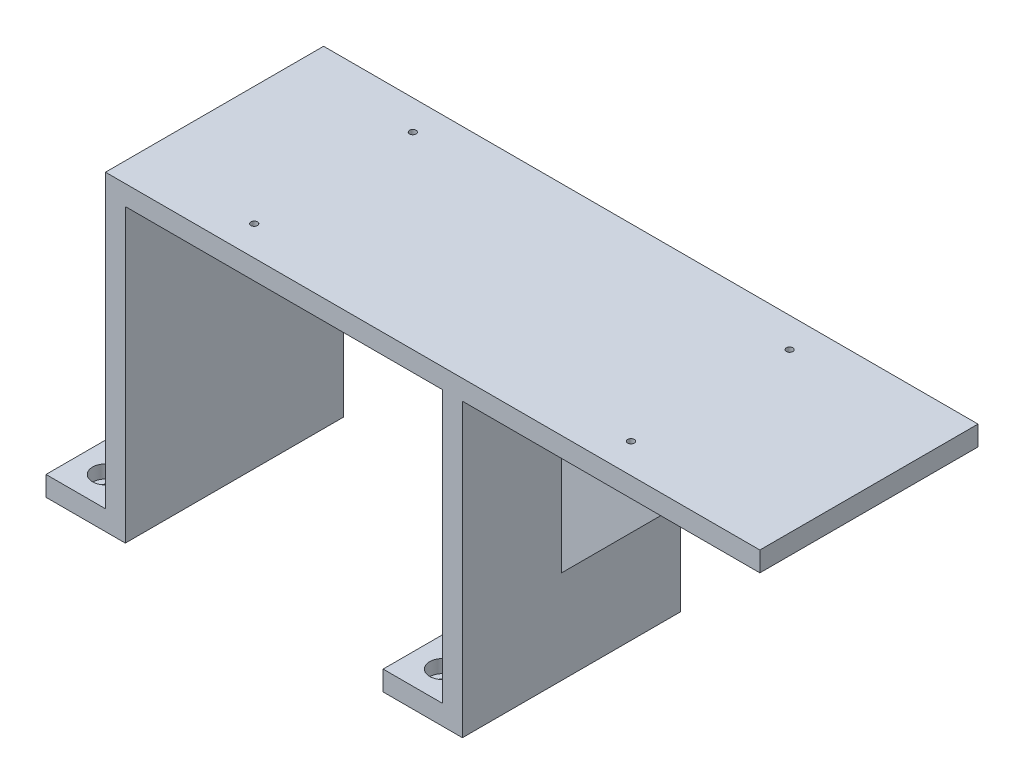
ISO-10303-21;
HEADER;
FILE_DESCRIPTION(('STEP AP214'),'2;1');
FILE_NAME('part.step','',(''),(''),'','','');
FILE_SCHEMA(('AUTOMOTIVE_DESIGN { 1 0 10303 214 1 1 1 1 }'));
ENDSEC;
DATA;
#1=APPLICATION_CONTEXT('core data for automotive mechanical design processes');
#2=APPLICATION_PROTOCOL_DEFINITION('international standard','automotive_design',2000,#1);
#3=PRODUCT_CONTEXT('',#1,'mechanical');
#4=PRODUCT('Part','Part','',(#3));
#5=PRODUCT_RELATED_PRODUCT_CATEGORY('part','',(#4));
#6=PRODUCT_DEFINITION_FORMATION('','',#4);
#7=PRODUCT_DEFINITION_CONTEXT('part definition',#1,'design');
#8=PRODUCT_DEFINITION('design','',#6,#7);
#9=PRODUCT_DEFINITION_SHAPE('','',#8);
#10=(LENGTH_UNIT() NAMED_UNIT(*) SI_UNIT(.MILLI.,.METRE.));
#11=(NAMED_UNIT(*) PLANE_ANGLE_UNIT() SI_UNIT($,.RADIAN.));
#12=(NAMED_UNIT(*) SI_UNIT($,.STERADIAN.) SOLID_ANGLE_UNIT());
#13=UNCERTAINTY_MEASURE_WITH_UNIT(LENGTH_MEASURE(1.E-05),#10,'distance_accuracy_value','');
#14=(GEOMETRIC_REPRESENTATION_CONTEXT(3) GLOBAL_UNCERTAINTY_ASSIGNED_CONTEXT((#13)) GLOBAL_UNIT_ASSIGNED_CONTEXT((#10,
#11,#12)) REPRESENTATION_CONTEXT('',''));
#15=CARTESIAN_POINT('',(0.,0.,0.));
#16=DIRECTION('',(0.,0.,1.));
#17=DIRECTION('',(1.,0.,0.));
#18=AXIS2_PLACEMENT_3D('',#15,#16,#17);
#19=CARTESIAN_POINT('',(210.,147.,110.));
#20=DIRECTION('',(-1.,0.,0.));
#21=DIRECTION('',(0.,-1.,0.));
#22=AXIS2_PLACEMENT_3D('',#19,#20,#21);
#23=PLANE('',#22);
#24=DIRECTION('',(0.,-1.,0.));
#25=VECTOR('',#24,1.);
#26=CARTESIAN_POINT('',(210.,137.,60.));
#27=LINE('',#26,#25);
#28=CARTESIAN_POINT('',(210.,137.,60.));
#29=VERTEX_POINT('',#28);
#30=CARTESIAN_POINT('',(210.,37.,60.));
#31=VERTEX_POINT('',#30);
#32=EDGE_CURVE('E183',#29,#31,#27,.T.);
#33=ORIENTED_EDGE('',*,*,#32,.F.);
#34=DIRECTION('',(0.,0.,1.));
#35=VECTOR('',#34,1.);
#36=CARTESIAN_POINT('',(210.,137.,0.));
#37=LINE('',#36,#35);
#38=CARTESIAN_POINT('',(210.,137.,110.));
#39=VERTEX_POINT('',#38);
#40=EDGE_CURVE('E203',#29,#39,#37,.T.);
#41=ORIENTED_EDGE('',*,*,#40,.T.);
#42=DIRECTION('',(0.,1.,0.));
#43=VECTOR('',#42,1.);
#44=CARTESIAN_POINT('',(210.,147.,110.));
#45=LINE('',#44,#43);
#46=CARTESIAN_POINT('',(210.,-10.,110.));
#47=VERTEX_POINT('',#46);
#48=EDGE_CURVE('E296',#47,#39,#45,.T.);
#49=ORIENTED_EDGE('',*,*,#48,.F.);
#50=DIRECTION('',(0.,0.,-1.));
#51=VECTOR('',#50,1.);
#52=CARTESIAN_POINT('',(210.,-10.,110.));
#53=LINE('',#52,#51);
#54=CARTESIAN_POINT('',(210.,-10.,0.));
#55=VERTEX_POINT('',#54);
#56=EDGE_CURVE('E357',#47,#55,#53,.T.);
#57=ORIENTED_EDGE('',*,*,#56,.T.);
#58=DIRECTION('',(0.,1.,0.));
#59=VECTOR('',#58,1.);
#60=CARTESIAN_POINT('',(210.,147.,0.));
#61=LINE('',#60,#59);
#62=CARTESIAN_POINT('',(210.,137.,0.));
#63=VERTEX_POINT('',#62);
#64=EDGE_CURVE('E334',#55,#63,#61,.T.);
#65=ORIENTED_EDGE('',*,*,#64,.T.);
#66=CARTESIAN_POINT('',(210.,137.,50.));
#67=VERTEX_POINT('',#66);
#68=EDGE_CURVE('E218',#63,#67,#37,.T.);
#69=ORIENTED_EDGE('',*,*,#68,.T.);
#70=DIRECTION('',(0.,-1.,0.));
#71=VECTOR('',#70,1.);
#72=CARTESIAN_POINT('',(210.,137.,50.));
#73=LINE('',#72,#71);
#74=CARTESIAN_POINT('',(210.,37.,50.));
#75=VERTEX_POINT('',#74);
#76=EDGE_CURVE('E66',#67,#75,#73,.T.);
#77=ORIENTED_EDGE('',*,*,#76,.T.);
#78=DIRECTION('',(0.,0.,-1.));
#79=VECTOR('',#78,1.);
#80=CARTESIAN_POINT('',(210.,37.,60.));
#81=LINE('',#80,#79);
#82=EDGE_CURVE('E61',#31,#75,#81,.T.);
#83=ORIENTED_EDGE('',*,*,#82,.F.);
#84=EDGE_LOOP('',(#33,#41,#49,#57,#65,#69,#77,#83));
#85=FACE_BOUND('',#84,.T.);
#86=ADVANCED_FACE('F43',(#85),#23,.F.);
#87=CARTESIAN_POINT('',(210.,137.,0.));
#88=DIRECTION('',(0.,-1.,0.));
#89=DIRECTION('',(0.,0.,-1.));
#90=AXIS2_PLACEMENT_3D('',#87,#88,#89);
#91=PLANE('',#90);
#92=CARTESIAN_POINT('',(280.,137.,15.));
#93=DIRECTION('',(0.,-1.,0.));
#94=DIRECTION('',(0.,0.,-1.));
#95=AXIS2_PLACEMENT_3D('',#92,#93,#94);
#96=CIRCLE('',#95,1.64999999999998);
#97=CARTESIAN_POINT('',(280.,137.,13.35));
#98=VERTEX_POINT('',#97);
#99=EDGE_CURVE('E535',#98,#98,#96,.T.);
#100=ORIENTED_EDGE('',*,*,#99,.F.);
#101=EDGE_LOOP('',(#100));
#102=FACE_BOUND('',#101,.T.);
#103=CARTESIAN_POINT('',(280.,137.,95.));
#104=DIRECTION('',(0.,-1.,0.));
#105=DIRECTION('',(0.,0.,-1.));
#106=AXIS2_PLACEMENT_3D('',#103,#104,#105);
#107=CIRCLE('',#106,1.64999999999998);
#108=CARTESIAN_POINT('',(280.,137.,93.35));
#109=VERTEX_POINT('',#108);
#110=EDGE_CURVE('E525',#109,#109,#107,.T.);
#111=ORIENTED_EDGE('',*,*,#110,.F.);
#112=EDGE_LOOP('',(#111));
#113=FACE_BOUND('',#112,.T.);
#114=ORIENTED_EDGE('',*,*,#40,.F.);
#115=DIRECTION('',(-1.,0.,0.));
#116=VECTOR('',#115,1.);
#117=CARTESIAN_POINT('',(310.,137.,60.));
#118=LINE('',#117,#116);
#119=CARTESIAN_POINT('',(310.,137.,60.));
#120=VERTEX_POINT('',#119);
#121=EDGE_CURVE('E171',#120,#29,#118,.T.);
#122=ORIENTED_EDGE('',*,*,#121,.F.);
#123=DIRECTION('',(0.,0.,-1.));
#124=VECTOR('',#123,1.);
#125=CARTESIAN_POINT('',(310.,137.,60.));
#126=LINE('',#125,#124);
#127=CARTESIAN_POINT('',(310.,137.,50.));
#128=VERTEX_POINT('',#127);
#129=EDGE_CURVE('E164',#120,#128,#126,.T.);
#130=ORIENTED_EDGE('',*,*,#129,.T.);
#131=DIRECTION('',(-1.,0.,0.));
#132=VECTOR('',#131,1.);
#133=CARTESIAN_POINT('',(310.,137.,50.));
#134=LINE('',#133,#132);
#135=EDGE_CURVE('E169',#128,#67,#134,.T.);
#136=ORIENTED_EDGE('',*,*,#135,.T.);
#137=ORIENTED_EDGE('',*,*,#68,.F.);
#138=DIRECTION('',(1.,0.,0.));
#139=VECTOR('',#138,1.);
#140=CARTESIAN_POINT('',(210.,137.,0.));
#141=LINE('',#140,#139);
#142=CARTESIAN_POINT('',(360.,137.,0.));
#143=VERTEX_POINT('',#142);
#144=EDGE_CURVE('E194',#63,#143,#141,.T.);
#145=ORIENTED_EDGE('',*,*,#144,.T.);
#146=DIRECTION('',(0.,0.,1.));
#147=VECTOR('',#146,1.);
#148=CARTESIAN_POINT('',(360.,137.,0.));
#149=LINE('',#148,#147);
#150=CARTESIAN_POINT('',(360.,137.,110.));
#151=VERTEX_POINT('',#150);
#152=EDGE_CURVE('E215',#143,#151,#149,.T.);
#153=ORIENTED_EDGE('',*,*,#152,.T.);
#154=DIRECTION('',(1.,0.,0.));
#155=VECTOR('',#154,1.);
#156=CARTESIAN_POINT('',(210.,137.,110.));
#157=LINE('',#156,#155);
#158=EDGE_CURVE('E193',#39,#151,#157,.T.);
#159=ORIENTED_EDGE('',*,*,#158,.F.);
#160=EDGE_LOOP('',(#114,#122,#130,#136,#137,#145,#153,#159));
#161=FACE_BOUND('',#160,.T.);
#162=ADVANCED_FACE('F167',(#102,#113,#161),#91,.T.);
#163=CARTESIAN_POINT('',(15.,-10.,15.));
#164=DIRECTION('',(0.,1.,0.));
#165=DIRECTION('',(0.,0.,1.));
#166=AXIS2_PLACEMENT_3D('',#163,#164,#165);
#167=CYLINDRICAL_SURFACE('',#166,3.3);
#168=CARTESIAN_POINT('',(15.,-10.,15.));
#169=DIRECTION('',(0.,1.,0.));
#170=DIRECTION('',(0.,0.,1.));
#171=AXIS2_PLACEMENT_3D('',#168,#169,#170);
#172=CIRCLE('',#171,3.3);
#173=CARTESIAN_POINT('',(15.,-10.,18.3));
#174=VERTEX_POINT('',#173);
#175=EDGE_CURVE('E257',#174,#174,#172,.T.);
#176=ORIENTED_EDGE('',*,*,#175,.F.);
#177=EDGE_LOOP('',(#176));
#178=FACE_BOUND('',#177,.T.);
#179=CARTESIAN_POINT('',(15.,-6.6,15.));
#180=DIRECTION('',(0.,1.,0.));
#181=DIRECTION('',(0.,0.,1.));
#182=AXIS2_PLACEMENT_3D('',#179,#180,#181);
#183=CIRCLE('',#182,3.3);
#184=CARTESIAN_POINT('',(15.,-6.6,18.3));
#185=VERTEX_POINT('',#184);
#186=EDGE_CURVE('E47',#185,#185,#183,.F.);
#187=ORIENTED_EDGE('',*,*,#186,.F.);
#188=EDGE_LOOP('',(#187));
#189=FACE_BOUND('',#188,.T.);
#190=ADVANCED_FACE('F401',(#178,#189),#167,.F.);
#191=CARTESIAN_POINT('',(15.,-10.,95.));
#192=DIRECTION('',(0.,1.,0.));
#193=DIRECTION('',(0.,0.,1.));
#194=AXIS2_PLACEMENT_3D('',#191,#192,#193);
#195=CYLINDRICAL_SURFACE('',#194,3.3);
#196=CARTESIAN_POINT('',(15.,-10.,95.));
#197=DIRECTION('',(0.,1.,0.));
#198=DIRECTION('',(0.,0.,1.));
#199=AXIS2_PLACEMENT_3D('',#196,#197,#198);
#200=CIRCLE('',#199,3.3);
#201=CARTESIAN_POINT('',(15.,-10.,98.3));
#202=VERTEX_POINT('',#201);
#203=EDGE_CURVE('E253',#202,#202,#200,.T.);
#204=ORIENTED_EDGE('',*,*,#203,.F.);
#205=EDGE_LOOP('',(#204));
#206=FACE_BOUND('',#205,.T.);
#207=CARTESIAN_POINT('',(15.,-6.6,95.));
#208=DIRECTION('',(0.,1.,0.));
#209=DIRECTION('',(0.,0.,1.));
#210=AXIS2_PLACEMENT_3D('',#207,#208,#209);
#211=CIRCLE('',#210,3.3);
#212=CARTESIAN_POINT('',(15.,-6.6,98.3));
#213=VERTEX_POINT('',#212);
#214=EDGE_CURVE('E390',#213,#213,#211,.F.);
#215=ORIENTED_EDGE('',*,*,#214,.F.);
#216=EDGE_LOOP('',(#215));
#217=FACE_BOUND('',#216,.T.);
#218=ADVANCED_FACE('F403',(#206,#217),#195,.F.);
#219=CARTESIAN_POINT('',(185.,-10.,95.));
#220=DIRECTION('',(0.,1.,0.));
#221=DIRECTION('',(0.,0.,1.));
#222=AXIS2_PLACEMENT_3D('',#219,#220,#221);
#223=CYLINDRICAL_SURFACE('',#222,3.3);
#224=CARTESIAN_POINT('',(185.,-10.,95.));
#225=DIRECTION('',(0.,1.,0.));
#226=DIRECTION('',(0.,0.,1.));
#227=AXIS2_PLACEMENT_3D('',#224,#225,#226);
#228=CIRCLE('',#227,3.3);
#229=CARTESIAN_POINT('',(185.,-10.,98.3));
#230=VERTEX_POINT('',#229);
#231=EDGE_CURVE('E258',#230,#230,#228,.T.);
#232=ORIENTED_EDGE('',*,*,#231,.F.);
#233=EDGE_LOOP('',(#232));
#234=FACE_BOUND('',#233,.T.);
#235=CARTESIAN_POINT('',(185.,-6.6,95.));
#236=DIRECTION('',(0.,1.,0.));
#237=DIRECTION('',(0.,0.,1.));
#238=AXIS2_PLACEMENT_3D('',#235,#236,#237);
#239=CIRCLE('',#238,3.3);
#240=CARTESIAN_POINT('',(185.,-6.6,98.3));
#241=VERTEX_POINT('',#240);
#242=EDGE_CURVE('E387',#241,#241,#239,.F.);
#243=ORIENTED_EDGE('',*,*,#242,.F.);
#244=EDGE_LOOP('',(#243));
#245=FACE_BOUND('',#244,.T.);
#246=ADVANCED_FACE('F410',(#234,#245),#223,.F.);
#247=CARTESIAN_POINT('',(185.,-10.,15.));
#248=DIRECTION('',(0.,1.,0.));
#249=DIRECTION('',(0.,0.,1.));
#250=AXIS2_PLACEMENT_3D('',#247,#248,#249);
#251=CYLINDRICAL_SURFACE('',#250,3.3);
#252=CARTESIAN_POINT('',(185.,-10.,15.));
#253=DIRECTION('',(0.,1.,0.));
#254=DIRECTION('',(0.,0.,1.));
#255=AXIS2_PLACEMENT_3D('',#252,#253,#254);
#256=CIRCLE('',#255,3.3);
#257=CARTESIAN_POINT('',(185.,-10.,18.3));
#258=VERTEX_POINT('',#257);
#259=EDGE_CURVE('E262',#258,#258,#256,.T.);
#260=ORIENTED_EDGE('',*,*,#259,.F.);
#261=EDGE_LOOP('',(#260));
#262=FACE_BOUND('',#261,.T.);
#263=CARTESIAN_POINT('',(185.,-6.6,15.));
#264=DIRECTION('',(0.,1.,0.));
#265=DIRECTION('',(0.,0.,1.));
#266=AXIS2_PLACEMENT_3D('',#263,#264,#265);
#267=CIRCLE('',#266,3.3);
#268=CARTESIAN_POINT('',(185.,-6.6,18.3));
#269=VERTEX_POINT('',#268);
#270=EDGE_CURVE('E249',#269,#269,#267,.F.);
#271=ORIENTED_EDGE('',*,*,#270,.F.);
#272=EDGE_LOOP('',(#271));
#273=FACE_BOUND('',#272,.T.);
#274=ADVANCED_FACE('F455',(#262,#273),#251,.F.);
#275=CARTESIAN_POINT('',(0.,0.,110.));
#276=DIRECTION('',(1.,0.,0.));
#277=DIRECTION('',(0.,1.,0.));
#278=AXIS2_PLACEMENT_3D('',#275,#276,#277);
#279=PLANE('',#278);
#280=DIRECTION('',(0.,-1.,0.));
#281=VECTOR('',#280,1.);
#282=CARTESIAN_POINT('',(0.,0.,0.));
#283=LINE('',#282,#281);
#284=CARTESIAN_POINT('',(0.,0.,0.));
#285=VERTEX_POINT('',#284);
#286=CARTESIAN_POINT('',(0.,-10.,0.));
#287=VERTEX_POINT('',#286);
#288=EDGE_CURVE('E269',#285,#287,#283,.T.);
#289=ORIENTED_EDGE('',*,*,#288,.T.);
#290=DIRECTION('',(0.,0.,-1.));
#291=VECTOR('',#290,1.);
#292=CARTESIAN_POINT('',(0.,-10.,110.));
#293=LINE('',#292,#291);
#294=CARTESIAN_POINT('',(0.,-10.,110.));
#295=VERTEX_POINT('',#294);
#296=EDGE_CURVE('E11',#295,#287,#293,.T.);
#297=ORIENTED_EDGE('',*,*,#296,.F.);
#298=DIRECTION('',(0.,-1.,0.));
#299=VECTOR('',#298,1.);
#300=CARTESIAN_POINT('',(0.,0.,110.));
#301=LINE('',#300,#299);
#302=CARTESIAN_POINT('',(0.,0.,110.));
#303=VERTEX_POINT('',#302);
#304=EDGE_CURVE('E270',#303,#295,#301,.T.);
#305=ORIENTED_EDGE('',*,*,#304,.F.);
#306=DIRECTION('',(0.,0.,-1.));
#307=VECTOR('',#306,1.);
#308=CARTESIAN_POINT('',(0.,0.,110.));
#309=LINE('',#308,#307);
#310=EDGE_CURVE('E309',#303,#285,#309,.T.);
#311=ORIENTED_EDGE('',*,*,#310,.T.);
#312=EDGE_LOOP('',(#289,#297,#305,#311));
#313=FACE_BOUND('',#312,.T.);
#314=ADVANCED_FACE('F45',(#313),#279,.F.);
#315=CARTESIAN_POINT('',(0.,-10.,110.));
#316=DIRECTION('',(0.,1.,0.));
#317=DIRECTION('',(0.,0.,1.));
#318=AXIS2_PLACEMENT_3D('',#315,#316,#317);
#319=PLANE('',#318);
#320=ORIENTED_EDGE('',*,*,#203,.T.);
#321=EDGE_LOOP('',(#320));
#322=FACE_BOUND('',#321,.T.);
#323=ORIENTED_EDGE('',*,*,#175,.T.);
#324=EDGE_LOOP('',(#323));
#325=FACE_BOUND('',#324,.T.);
#326=DIRECTION('',(1.,0.,0.));
#327=VECTOR('',#326,1.);
#328=CARTESIAN_POINT('',(0.,-10.,0.));
#329=LINE('',#328,#327);
#330=CARTESIAN_POINT('',(40.,-10.,0.));
#331=VERTEX_POINT('',#330);
#332=EDGE_CURVE('E313',#287,#331,#329,.T.);
#333=ORIENTED_EDGE('',*,*,#332,.T.);
#334=DIRECTION('',(0.,0.,-1.));
#335=VECTOR('',#334,1.);
#336=CARTESIAN_POINT('',(40.,-10.,110.));
#337=LINE('',#336,#335);
#338=CARTESIAN_POINT('',(40.,-10.,110.));
#339=VERTEX_POINT('',#338);
#340=EDGE_CURVE('E53',#339,#331,#337,.T.);
#341=ORIENTED_EDGE('',*,*,#340,.F.);
#342=DIRECTION('',(1.,0.,0.));
#343=VECTOR('',#342,1.);
#344=CARTESIAN_POINT('',(0.,-10.,110.));
#345=LINE('',#344,#343);
#346=EDGE_CURVE('E274',#295,#339,#345,.T.);
#347=ORIENTED_EDGE('',*,*,#346,.F.);
#348=ORIENTED_EDGE('',*,*,#296,.T.);
#349=EDGE_LOOP('',(#333,#341,#347,#348));
#350=FACE_BOUND('',#349,.T.);
#351=ADVANCED_FACE('F448',(#322,#325,#350),#319,.F.);
#352=CARTESIAN_POINT('',(40.,-10.,110.));
#353=DIRECTION('',(-1.,0.,0.));
#354=DIRECTION('',(0.,0.,1.));
#355=AXIS2_PLACEMENT_3D('',#352,#353,#354);
#356=PLANE('',#355);
#357=DIRECTION('',(0.,1.,0.));
#358=VECTOR('',#357,1.);
#359=CARTESIAN_POINT('',(40.,-10.,0.));
#360=LINE('',#359,#358);
#361=CARTESIAN_POINT('',(40.,137.,0.));
#362=VERTEX_POINT('',#361);
#363=EDGE_CURVE('E316',#331,#362,#360,.T.);
#364=ORIENTED_EDGE('',*,*,#363,.T.);
#365=DIRECTION('',(0.,0.,-1.));
#366=VECTOR('',#365,1.);
#367=CARTESIAN_POINT('',(40.,137.,110.));
#368=LINE('',#367,#366);
#369=CARTESIAN_POINT('',(40.,137.,110.));
#370=VERTEX_POINT('',#369);
#371=EDGE_CURVE('E377',#370,#362,#368,.T.);
#372=ORIENTED_EDGE('',*,*,#371,.F.);
#373=DIRECTION('',(0.,1.,0.));
#374=VECTOR('',#373,1.);
#375=CARTESIAN_POINT('',(40.,-10.,110.));
#376=LINE('',#375,#374);
#377=EDGE_CURVE('E278',#339,#370,#376,.T.);
#378=ORIENTED_EDGE('',*,*,#377,.F.);
#379=ORIENTED_EDGE('',*,*,#340,.T.);
#380=EDGE_LOOP('',(#364,#372,#378,#379));
#381=FACE_BOUND('',#380,.T.);
#382=ADVANCED_FACE('F445',(#381),#356,.F.);
#383=CARTESIAN_POINT('',(40.,137.,110.));
#384=DIRECTION('',(0.,1.,0.));
#385=DIRECTION('',(0.,0.,1.));
#386=AXIS2_PLACEMENT_3D('',#383,#384,#385);
#387=PLANE('',#386);
#388=CARTESIAN_POINT('',(90.,137.,15.));
#389=DIRECTION('',(0.,1.,0.));
#390=DIRECTION('',(0.,0.,1.));
#391=AXIS2_PLACEMENT_3D('',#388,#389,#390);
#392=CIRCLE('',#391,1.64999999999998);
#393=CARTESIAN_POINT('',(90.,137.,16.65));
#394=VERTEX_POINT('',#393);
#395=EDGE_CURVE('E543',#394,#394,#392,.T.);
#396=ORIENTED_EDGE('',*,*,#395,.T.);
#397=EDGE_LOOP('',(#396));
#398=FACE_BOUND('',#397,.T.);
#399=CARTESIAN_POINT('',(90.,137.,95.));
#400=DIRECTION('',(0.,1.,0.));
#401=DIRECTION('',(0.,0.,1.));
#402=AXIS2_PLACEMENT_3D('',#399,#400,#401);
#403=CIRCLE('',#402,1.64999999999998);
#404=CARTESIAN_POINT('',(90.,137.,96.65));
#405=VERTEX_POINT('',#404);
#406=EDGE_CURVE('E517',#405,#405,#403,.T.);
#407=ORIENTED_EDGE('',*,*,#406,.T.);
#408=EDGE_LOOP('',(#407));
#409=FACE_BOUND('',#408,.T.);
#410=DIRECTION('',(1.,0.,0.));
#411=VECTOR('',#410,1.);
#412=CARTESIAN_POINT('',(40.,137.,0.));
#413=LINE('',#412,#411);
#414=CARTESIAN_POINT('',(200.,137.,0.));
#415=VERTEX_POINT('',#414);
#416=EDGE_CURVE('E319',#362,#415,#413,.T.);
#417=ORIENTED_EDGE('',*,*,#416,.T.);
#418=DIRECTION('',(0.,0.,-1.));
#419=VECTOR('',#418,1.);
#420=CARTESIAN_POINT('',(200.,137.,110.));
#421=LINE('',#420,#419);
#422=CARTESIAN_POINT('',(200.,137.,110.));
#423=VERTEX_POINT('',#422);
#424=EDGE_CURVE('E373',#423,#415,#421,.T.);
#425=ORIENTED_EDGE('',*,*,#424,.F.);
#426=DIRECTION('',(1.,0.,0.));
#427=VECTOR('',#426,1.);
#428=CARTESIAN_POINT('',(40.,137.,110.));
#429=LINE('',#428,#427);
#430=EDGE_CURVE('E281',#370,#423,#429,.T.);
#431=ORIENTED_EDGE('',*,*,#430,.F.);
#432=ORIENTED_EDGE('',*,*,#371,.T.);
#433=EDGE_LOOP('',(#417,#425,#431,#432));
#434=FACE_BOUND('',#433,.T.);
#435=ADVANCED_FACE('F441',(#398,#409,#434),#387,.F.);
#436=CARTESIAN_POINT('',(200.,137.,110.));
#437=DIRECTION('',(1.,0.,0.));
#438=DIRECTION('',(0.,1.,0.));
#439=AXIS2_PLACEMENT_3D('',#436,#437,#438);
#440=PLANE('',#439);
#441=DIRECTION('',(0.,-1.,0.));
#442=VECTOR('',#441,1.);
#443=CARTESIAN_POINT('',(200.,137.,0.));
#444=LINE('',#443,#442);
#445=CARTESIAN_POINT('',(200.,0.,0.));
#446=VERTEX_POINT('',#445);
#447=EDGE_CURVE('E322',#415,#446,#444,.T.);
#448=ORIENTED_EDGE('',*,*,#447,.T.);
#449=DIRECTION('',(0.,0.,-1.));
#450=VECTOR('',#449,1.);
#451=CARTESIAN_POINT('',(200.,0.,110.));
#452=LINE('',#451,#450);
#453=CARTESIAN_POINT('',(200.,0.,110.));
#454=VERTEX_POINT('',#453);
#455=EDGE_CURVE('E369',#454,#446,#452,.T.);
#456=ORIENTED_EDGE('',*,*,#455,.F.);
#457=DIRECTION('',(0.,-1.,0.));
#458=VECTOR('',#457,1.);
#459=CARTESIAN_POINT('',(200.,137.,110.));
#460=LINE('',#459,#458);
#461=EDGE_CURVE('E284',#423,#454,#460,.T.);
#462=ORIENTED_EDGE('',*,*,#461,.F.);
#463=ORIENTED_EDGE('',*,*,#424,.T.);
#464=EDGE_LOOP('',(#448,#456,#462,#463));
#465=FACE_BOUND('',#464,.T.);
#466=ADVANCED_FACE('F437',(#465),#440,.F.);
#467=CARTESIAN_POINT('',(170.,0.,110.));
#468=DIRECTION('',(0.,-1.,0.));
#469=DIRECTION('',(0.,0.,-1.));
#470=AXIS2_PLACEMENT_3D('',#467,#468,#469);
#471=PLANE('',#470);
#472=CARTESIAN_POINT('',(185.,0.,15.));
#473=DIRECTION('',(0.,1.,0.));
#474=DIRECTION('',(0.,0.,1.));
#475=AXIS2_PLACEMENT_3D('',#472,#473,#474);
#476=CIRCLE('',#475,6.50000000000002);
#477=CARTESIAN_POINT('',(185.,0.,21.5));
#478=VERTEX_POINT('',#477);
#479=EDGE_CURVE('E214',#478,#478,#476,.T.);
#480=ORIENTED_EDGE('',*,*,#479,.F.);
#481=EDGE_LOOP('',(#480));
#482=FACE_BOUND('',#481,.T.);
#483=CARTESIAN_POINT('',(185.,0.,95.));
#484=DIRECTION('',(0.,1.,0.));
#485=DIRECTION('',(0.,0.,1.));
#486=AXIS2_PLACEMENT_3D('',#483,#484,#485);
#487=CIRCLE('',#486,6.50000000000002);
#488=CARTESIAN_POINT('',(185.,0.,101.5));
#489=VERTEX_POINT('',#488);
#490=EDGE_CURVE('E234',#489,#489,#487,.T.);
#491=ORIENTED_EDGE('',*,*,#490,.F.);
#492=EDGE_LOOP('',(#491));
#493=FACE_BOUND('',#492,.T.);
#494=DIRECTION('',(-1.,0.,0.));
#495=VECTOR('',#494,1.);
#496=CARTESIAN_POINT('',(170.,0.,0.));
#497=LINE('',#496,#495);
#498=CARTESIAN_POINT('',(170.,0.,0.));
#499=VERTEX_POINT('',#498);
#500=EDGE_CURVE('E325',#446,#499,#497,.T.);
#501=ORIENTED_EDGE('',*,*,#500,.T.);
#502=DIRECTION('',(0.,0.,-1.));
#503=VECTOR('',#502,1.);
#504=CARTESIAN_POINT('',(170.,0.,110.));
#505=LINE('',#504,#503);
#506=CARTESIAN_POINT('',(170.,0.,110.));
#507=VERTEX_POINT('',#506);
#508=EDGE_CURVE('E365',#507,#499,#505,.T.);
#509=ORIENTED_EDGE('',*,*,#508,.F.);
#510=DIRECTION('',(-1.,0.,0.));
#511=VECTOR('',#510,1.);
#512=CARTESIAN_POINT('',(170.,0.,110.));
#513=LINE('',#512,#511);
#514=EDGE_CURVE('E287',#454,#507,#513,.T.);
#515=ORIENTED_EDGE('',*,*,#514,.F.);
#516=ORIENTED_EDGE('',*,*,#455,.T.);
#517=EDGE_LOOP('',(#501,#509,#515,#516));
#518=FACE_BOUND('',#517,.T.);
#519=ADVANCED_FACE('F433',(#482,#493,#518),#471,.F.);
#520=CARTESIAN_POINT('',(170.,-10.,110.));
#521=DIRECTION('',(1.,0.,0.));
#522=DIRECTION('',(0.,0.,-1.));
#523=AXIS2_PLACEMENT_3D('',#520,#521,#522);
#524=PLANE('',#523);
#525=DIRECTION('',(0.,-1.,0.));
#526=VECTOR('',#525,1.);
#527=CARTESIAN_POINT('',(170.,-10.,0.));
#528=LINE('',#527,#526);
#529=CARTESIAN_POINT('',(170.,-10.,0.));
#530=VERTEX_POINT('',#529);
#531=EDGE_CURVE('E328',#499,#530,#528,.T.);
#532=ORIENTED_EDGE('',*,*,#531,.T.);
#533=DIRECTION('',(0.,0.,-1.));
#534=VECTOR('',#533,1.);
#535=CARTESIAN_POINT('',(170.,-10.,110.));
#536=LINE('',#535,#534);
#537=CARTESIAN_POINT('',(170.,-10.,110.));
#538=VERTEX_POINT('',#537);
#539=EDGE_CURVE('E361',#538,#530,#536,.T.);
#540=ORIENTED_EDGE('',*,*,#539,.F.);
#541=DIRECTION('',(0.,-1.,0.));
#542=VECTOR('',#541,1.);
#543=CARTESIAN_POINT('',(170.,-10.,110.));
#544=LINE('',#543,#542);
#545=EDGE_CURVE('E290',#507,#538,#544,.T.);
#546=ORIENTED_EDGE('',*,*,#545,.F.);
#547=ORIENTED_EDGE('',*,*,#508,.T.);
#548=EDGE_LOOP('',(#532,#540,#546,#547));
#549=FACE_BOUND('',#548,.T.);
#550=ADVANCED_FACE('F429',(#549),#524,.F.);
#551=CARTESIAN_POINT('',(210.,-10.,110.));
#552=DIRECTION('',(0.,1.,0.));
#553=DIRECTION('',(-1.,0.,0.));
#554=AXIS2_PLACEMENT_3D('',#551,#552,#553);
#555=PLANE('',#554);
#556=ORIENTED_EDGE('',*,*,#259,.T.);
#557=EDGE_LOOP('',(#556));
#558=FACE_BOUND('',#557,.T.);
#559=ORIENTED_EDGE('',*,*,#231,.T.);
#560=EDGE_LOOP('',(#559));
#561=FACE_BOUND('',#560,.T.);
#562=DIRECTION('',(1.,0.,0.));
#563=VECTOR('',#562,1.);
#564=CARTESIAN_POINT('',(210.,-10.,0.));
#565=LINE('',#564,#563);
#566=EDGE_CURVE('E331',#530,#55,#565,.T.);
#567=ORIENTED_EDGE('',*,*,#566,.T.);
#568=ORIENTED_EDGE('',*,*,#56,.F.);
#569=DIRECTION('',(1.,0.,0.));
#570=VECTOR('',#569,1.);
#571=CARTESIAN_POINT('',(210.,-10.,110.));
#572=LINE('',#571,#570);
#573=EDGE_CURVE('E293',#538,#47,#572,.T.);
#574=ORIENTED_EDGE('',*,*,#573,.F.);
#575=ORIENTED_EDGE('',*,*,#539,.T.);
#576=EDGE_LOOP('',(#567,#568,#574,#575));
#577=FACE_BOUND('',#576,.T.);
#578=ADVANCED_FACE('F426',(#558,#561,#577),#555,.F.);
#579=CARTESIAN_POINT('',(30.,147.,110.));
#580=DIRECTION('',(0.,-1.,0.));
#581=DIRECTION('',(0.,0.,-1.));
#582=AXIS2_PLACEMENT_3D('',#579,#580,#581);
#583=PLANE('',#582);
#584=CARTESIAN_POINT('',(90.,147.,15.));
#585=DIRECTION('',(0.,1.,0.));
#586=DIRECTION('',(0.,0.,1.));
#587=AXIS2_PLACEMENT_3D('',#584,#585,#586);
#588=CIRCLE('',#587,1.64999999999998);
#589=CARTESIAN_POINT('',(90.,147.,16.65));
#590=VERTEX_POINT('',#589);
#591=EDGE_CURVE('E547',#590,#590,#588,.T.);
#592=ORIENTED_EDGE('',*,*,#591,.F.);
#593=EDGE_LOOP('',(#592));
#594=FACE_BOUND('',#593,.T.);
#595=CARTESIAN_POINT('',(280.,147.,15.));
#596=DIRECTION('',(0.,1.,0.));
#597=DIRECTION('',(0.,0.,1.));
#598=AXIS2_PLACEMENT_3D('',#595,#596,#597);
#599=CIRCLE('',#598,1.64999999999998);
#600=CARTESIAN_POINT('',(280.,147.,16.65));
#601=VERTEX_POINT('',#600);
#602=EDGE_CURVE('E539',#601,#601,#599,.T.);
#603=ORIENTED_EDGE('',*,*,#602,.F.);
#604=EDGE_LOOP('',(#603));
#605=FACE_BOUND('',#604,.T.);
#606=CARTESIAN_POINT('',(280.,147.,95.));
#607=DIRECTION('',(0.,1.,0.));
#608=DIRECTION('',(0.,0.,1.));
#609=AXIS2_PLACEMENT_3D('',#606,#607,#608);
#610=CIRCLE('',#609,1.64999999999998);
#611=CARTESIAN_POINT('',(280.,147.,96.65));
#612=VERTEX_POINT('',#611);
#613=EDGE_CURVE('E531',#612,#612,#610,.T.);
#614=ORIENTED_EDGE('',*,*,#613,.F.);
#615=EDGE_LOOP('',(#614));
#616=FACE_BOUND('',#615,.T.);
#617=CARTESIAN_POINT('',(90.,147.,95.));
#618=DIRECTION('',(0.,1.,0.));
#619=DIRECTION('',(0.,0.,1.));
#620=AXIS2_PLACEMENT_3D('',#617,#618,#619);
#621=CIRCLE('',#620,1.64999999999998);
#622=CARTESIAN_POINT('',(90.,147.,96.65));
#623=VERTEX_POINT('',#622);
#624=EDGE_CURVE('E520',#623,#623,#621,.T.);
#625=ORIENTED_EDGE('',*,*,#624,.F.);
#626=EDGE_LOOP('',(#625));
#627=FACE_BOUND('',#626,.T.);
#628=DIRECTION('',(-1.,0.,0.));
#629=VECTOR('',#628,1.);
#630=CARTESIAN_POINT('',(30.,147.,0.));
#631=LINE('',#630,#629);
#632=CARTESIAN_POINT('',(360.,147.,0.));
#633=VERTEX_POINT('',#632);
#634=CARTESIAN_POINT('',(30.,147.,0.));
#635=VERTEX_POINT('',#634);
#636=EDGE_CURVE('E338',#633,#635,#631,.T.);
#637=ORIENTED_EDGE('',*,*,#636,.T.);
#638=DIRECTION('',(0.,0.,-1.));
#639=VECTOR('',#638,1.);
#640=CARTESIAN_POINT('',(30.,147.,110.));
#641=LINE('',#640,#639);
#642=CARTESIAN_POINT('',(30.,147.,110.));
#643=VERTEX_POINT('',#642);
#644=EDGE_CURVE('E353',#643,#635,#641,.T.);
#645=ORIENTED_EDGE('',*,*,#644,.F.);
#646=DIRECTION('',(-1.,0.,0.));
#647=VECTOR('',#646,1.);
#648=CARTESIAN_POINT('',(30.,147.,110.));
#649=LINE('',#648,#647);
#650=CARTESIAN_POINT('',(360.,147.,110.));
#651=VERTEX_POINT('',#650);
#652=EDGE_CURVE('E300',#651,#643,#649,.T.);
#653=ORIENTED_EDGE('',*,*,#652,.F.);
#654=DIRECTION('',(0.,0.,1.));
#655=VECTOR('',#654,1.);
#656=CARTESIAN_POINT('',(360.,147.,0.));
#657=LINE('',#656,#655);
#658=EDGE_CURVE('E210',#633,#651,#657,.T.);
#659=ORIENTED_EDGE('',*,*,#658,.F.);
#660=EDGE_LOOP('',(#637,#645,#653,#659));
#661=FACE_BOUND('',#660,.T.);
#662=ADVANCED_FACE('F424',(#594,#605,#616,#627,#661),#583,.F.);
#663=CARTESIAN_POINT('',(30.,0.,110.));
#664=DIRECTION('',(1.,0.,0.));
#665=DIRECTION('',(0.,0.,-1.));
#666=AXIS2_PLACEMENT_3D('',#663,#664,#665);
#667=PLANE('',#666);
#668=DIRECTION('',(0.,-1.,0.));
#669=VECTOR('',#668,1.);
#670=CARTESIAN_POINT('',(30.,0.,0.));
#671=LINE('',#670,#669);
#672=CARTESIAN_POINT('',(30.,0.,0.));
#673=VERTEX_POINT('',#672);
#674=EDGE_CURVE('E341',#635,#673,#671,.T.);
#675=ORIENTED_EDGE('',*,*,#674,.T.);
#676=DIRECTION('',(0.,0.,-1.));
#677=VECTOR('',#676,1.);
#678=CARTESIAN_POINT('',(30.,0.,110.));
#679=LINE('',#678,#677);
#680=CARTESIAN_POINT('',(30.,0.,110.));
#681=VERTEX_POINT('',#680);
#682=EDGE_CURVE('E349',#681,#673,#679,.T.);
#683=ORIENTED_EDGE('',*,*,#682,.F.);
#684=DIRECTION('',(0.,-1.,0.));
#685=VECTOR('',#684,1.);
#686=CARTESIAN_POINT('',(30.,0.,110.));
#687=LINE('',#686,#685);
#688=EDGE_CURVE('E303',#643,#681,#687,.T.);
#689=ORIENTED_EDGE('',*,*,#688,.F.);
#690=ORIENTED_EDGE('',*,*,#644,.T.);
#691=EDGE_LOOP('',(#675,#683,#689,#690));
#692=FACE_BOUND('',#691,.T.);
#693=ADVANCED_FACE('F490',(#692),#667,.F.);
#694=CARTESIAN_POINT('',(0.,0.,110.));
#695=DIRECTION('',(0.,-1.,0.));
#696=DIRECTION('',(0.,0.,-1.));
#697=AXIS2_PLACEMENT_3D('',#694,#695,#696);
#698=PLANE('',#697);
#699=CARTESIAN_POINT('',(15.,0.,95.));
#700=DIRECTION('',(0.,1.,0.));
#701=DIRECTION('',(0.,0.,1.));
#702=AXIS2_PLACEMENT_3D('',#699,#700,#701);
#703=CIRCLE('',#702,6.5);
#704=CARTESIAN_POINT('',(15.,0.,101.5));
#705=VERTEX_POINT('',#704);
#706=EDGE_CURVE('E226',#705,#705,#703,.T.);
#707=ORIENTED_EDGE('',*,*,#706,.F.);
#708=EDGE_LOOP('',(#707));
#709=FACE_BOUND('',#708,.T.);
#710=CARTESIAN_POINT('',(15.,0.,15.));
#711=DIRECTION('',(0.,1.,0.));
#712=DIRECTION('',(0.,0.,1.));
#713=AXIS2_PLACEMENT_3D('',#710,#711,#712);
#714=CIRCLE('',#713,6.5);
#715=CARTESIAN_POINT('',(15.,0.,21.5));
#716=VERTEX_POINT('',#715);
#717=EDGE_CURVE('E225',#716,#716,#714,.T.);
#718=ORIENTED_EDGE('',*,*,#717,.F.);
#719=EDGE_LOOP('',(#718));
#720=FACE_BOUND('',#719,.T.);
#721=DIRECTION('',(-1.,0.,0.));
#722=VECTOR('',#721,1.);
#723=CARTESIAN_POINT('',(0.,0.,0.));
#724=LINE('',#723,#722);
#725=EDGE_CURVE('E275',#673,#285,#724,.T.);
#726=ORIENTED_EDGE('',*,*,#725,.T.);
#727=ORIENTED_EDGE('',*,*,#310,.F.);
#728=DIRECTION('',(-1.,0.,0.));
#729=VECTOR('',#728,1.);
#730=CARTESIAN_POINT('',(0.,0.,110.));
#731=LINE('',#730,#729);
#732=EDGE_CURVE('E306',#681,#303,#731,.T.);
#733=ORIENTED_EDGE('',*,*,#732,.F.);
#734=ORIENTED_EDGE('',*,*,#682,.T.);
#735=EDGE_LOOP('',(#726,#727,#733,#734));
#736=FACE_BOUND('',#735,.T.);
#737=ADVANCED_FACE('F486',(#709,#720,#736),#698,.F.);
#738=CARTESIAN_POINT('',(0.,0.,110.));
#739=DIRECTION('',(0.,0.,1.));
#740=DIRECTION('',(1.,0.,0.));
#741=AXIS2_PLACEMENT_3D('',#738,#739,#740);
#742=PLANE('',#741);
#743=ORIENTED_EDGE('',*,*,#304,.T.);
#744=ORIENTED_EDGE('',*,*,#346,.T.);
#745=ORIENTED_EDGE('',*,*,#377,.T.);
#746=ORIENTED_EDGE('',*,*,#430,.T.);
#747=ORIENTED_EDGE('',*,*,#461,.T.);
#748=ORIENTED_EDGE('',*,*,#514,.T.);
#749=ORIENTED_EDGE('',*,*,#545,.T.);
#750=ORIENTED_EDGE('',*,*,#573,.T.);
#751=ORIENTED_EDGE('',*,*,#48,.T.);
#752=ORIENTED_EDGE('',*,*,#158,.T.);
#753=DIRECTION('',(0.,1.,0.));
#754=VECTOR('',#753,1.);
#755=CARTESIAN_POINT('',(360.,147.,110.));
#756=LINE('',#755,#754);
#757=EDGE_CURVE('E199',#151,#651,#756,.T.);
#758=ORIENTED_EDGE('',*,*,#757,.T.);
#759=ORIENTED_EDGE('',*,*,#652,.T.);
#760=ORIENTED_EDGE('',*,*,#688,.T.);
#761=ORIENTED_EDGE('',*,*,#732,.T.);
#762=EDGE_LOOP('',(#743,#744,#745,#746,#747,#748,#749,#750,#751,#752,#758,#759,#760,#761));
#763=FACE_BOUND('',#762,.T.);
#764=ADVANCED_FACE('F478',(#763),#742,.T.);
#765=CARTESIAN_POINT('',(0.,0.,0.));
#766=DIRECTION('',(0.,0.,1.));
#767=DIRECTION('',(1.,0.,0.));
#768=AXIS2_PLACEMENT_3D('',#765,#766,#767);
#769=PLANE('',#768);
#770=ORIENTED_EDGE('',*,*,#288,.F.);
#771=ORIENTED_EDGE('',*,*,#725,.F.);
#772=ORIENTED_EDGE('',*,*,#674,.F.);
#773=ORIENTED_EDGE('',*,*,#636,.F.);
#774=DIRECTION('',(0.,1.,0.));
#775=VECTOR('',#774,1.);
#776=CARTESIAN_POINT('',(360.,147.,0.));
#777=LINE('',#776,#775);
#778=EDGE_CURVE('E198',#143,#633,#777,.T.);
#779=ORIENTED_EDGE('',*,*,#778,.F.);
#780=ORIENTED_EDGE('',*,*,#144,.F.);
#781=ORIENTED_EDGE('',*,*,#64,.F.);
#782=ORIENTED_EDGE('',*,*,#566,.F.);
#783=ORIENTED_EDGE('',*,*,#531,.F.);
#784=ORIENTED_EDGE('',*,*,#500,.F.);
#785=ORIENTED_EDGE('',*,*,#447,.F.);
#786=ORIENTED_EDGE('',*,*,#416,.F.);
#787=ORIENTED_EDGE('',*,*,#363,.F.);
#788=ORIENTED_EDGE('',*,*,#332,.F.);
#789=EDGE_LOOP('',(#770,#771,#772,#773,#779,#780,#781,#782,#783,#784,#785,#786,#787,#788));
#790=FACE_BOUND('',#789,.T.);
#791=ADVANCED_FACE('F468',(#790),#769,.F.);
#792=CARTESIAN_POINT('',(185.,-6.6,15.));
#793=DIRECTION('',(0.,1.,0.));
#794=DIRECTION('',(0.,0.,1.));
#795=AXIS2_PLACEMENT_3D('',#792,#793,#794);
#796=PLANE('',#795);
#797=CARTESIAN_POINT('',(185.,-6.6,15.));
#798=DIRECTION('',(0.,1.,0.));
#799=DIRECTION('',(0.,0.,1.));
#800=AXIS2_PLACEMENT_3D('',#797,#798,#799);
#801=CIRCLE('',#800,6.50000000000002);
#802=CARTESIAN_POINT('',(185.,-6.6,21.5));
#803=VERTEX_POINT('',#802);
#804=EDGE_CURVE('E238',#803,#803,#801,.T.);
#805=ORIENTED_EDGE('',*,*,#804,.T.);
#806=EDGE_LOOP('',(#805));
#807=FACE_BOUND('',#806,.T.);
#808=ORIENTED_EDGE('',*,*,#270,.T.);
#809=EDGE_LOOP('',(#808));
#810=FACE_BOUND('',#809,.T.);
#811=ADVANCED_FACE('F604',(#807,#810),#796,.T.);
#812=CARTESIAN_POINT('',(185.,-6.6,15.));
#813=DIRECTION('',(0.,1.,0.));
#814=DIRECTION('',(0.,0.,1.));
#815=AXIS2_PLACEMENT_3D('',#812,#813,#814);
#816=CYLINDRICAL_SURFACE('',#815,6.50000000000002);
#817=ORIENTED_EDGE('',*,*,#804,.F.);
#818=EDGE_LOOP('',(#817));
#819=FACE_BOUND('',#818,.T.);
#820=ORIENTED_EDGE('',*,*,#479,.T.);
#821=EDGE_LOOP('',(#820));
#822=FACE_BOUND('',#821,.T.);
#823=ADVANCED_FACE('F599',(#819,#822),#816,.F.);
#824=CARTESIAN_POINT('',(185.,-6.6,95.));
#825=DIRECTION('',(0.,1.,0.));
#826=DIRECTION('',(0.,0.,1.));
#827=AXIS2_PLACEMENT_3D('',#824,#825,#826);
#828=PLANE('',#827);
#829=CARTESIAN_POINT('',(185.,-6.6,95.));
#830=DIRECTION('',(0.,1.,0.));
#831=DIRECTION('',(0.,0.,1.));
#832=AXIS2_PLACEMENT_3D('',#829,#830,#831);
#833=CIRCLE('',#832,6.50000000000002);
#834=CARTESIAN_POINT('',(185.,-6.6,101.5));
#835=VERTEX_POINT('',#834);
#836=EDGE_CURVE('E230',#835,#835,#833,.T.);
#837=ORIENTED_EDGE('',*,*,#836,.T.);
#838=EDGE_LOOP('',(#837));
#839=FACE_BOUND('',#838,.T.);
#840=ORIENTED_EDGE('',*,*,#242,.T.);
#841=EDGE_LOOP('',(#840));
#842=FACE_BOUND('',#841,.T.);
#843=ADVANCED_FACE('F596',(#839,#842),#828,.T.);
#844=CARTESIAN_POINT('',(185.,-6.6,95.));
#845=DIRECTION('',(0.,1.,0.));
#846=DIRECTION('',(0.,0.,1.));
#847=AXIS2_PLACEMENT_3D('',#844,#845,#846);
#848=CYLINDRICAL_SURFACE('',#847,6.50000000000002);
#849=ORIENTED_EDGE('',*,*,#836,.F.);
#850=EDGE_LOOP('',(#849));
#851=FACE_BOUND('',#850,.T.);
#852=ORIENTED_EDGE('',*,*,#490,.T.);
#853=EDGE_LOOP('',(#852));
#854=FACE_BOUND('',#853,.T.);
#855=ADVANCED_FACE('F591',(#851,#854),#848,.F.);
#856=CARTESIAN_POINT('',(15.,-6.6,95.));
#857=DIRECTION('',(0.,1.,0.));
#858=DIRECTION('',(0.,0.,1.));
#859=AXIS2_PLACEMENT_3D('',#856,#857,#858);
#860=PLANE('',#859);
#861=CARTESIAN_POINT('',(15.,-6.6,95.));
#862=DIRECTION('',(0.,1.,0.));
#863=DIRECTION('',(0.,0.,1.));
#864=AXIS2_PLACEMENT_3D('',#861,#862,#863);
#865=CIRCLE('',#864,6.5);
#866=CARTESIAN_POINT('',(15.,-6.6,101.5));
#867=VERTEX_POINT('',#866);
#868=EDGE_CURVE('E221',#867,#867,#865,.T.);
#869=ORIENTED_EDGE('',*,*,#868,.T.);
#870=EDGE_LOOP('',(#869));
#871=FACE_BOUND('',#870,.T.);
#872=ORIENTED_EDGE('',*,*,#214,.T.);
#873=EDGE_LOOP('',(#872));
#874=FACE_BOUND('',#873,.T.);
#875=ADVANCED_FACE('F587',(#871,#874),#860,.T.);
#876=CARTESIAN_POINT('',(15.,-6.6,95.));
#877=DIRECTION('',(0.,1.,0.));
#878=DIRECTION('',(0.,0.,1.));
#879=AXIS2_PLACEMENT_3D('',#876,#877,#878);
#880=CYLINDRICAL_SURFACE('',#879,6.5);
#881=ORIENTED_EDGE('',*,*,#868,.F.);
#882=EDGE_LOOP('',(#881));
#883=FACE_BOUND('',#882,.T.);
#884=ORIENTED_EDGE('',*,*,#706,.T.);
#885=EDGE_LOOP('',(#884));
#886=FACE_BOUND('',#885,.T.);
#887=ADVANCED_FACE('F590',(#883,#886),#880,.F.);
#888=CARTESIAN_POINT('',(15.,-6.6,15.));
#889=DIRECTION('',(0.,1.,0.));
#890=DIRECTION('',(0.,0.,1.));
#891=AXIS2_PLACEMENT_3D('',#888,#889,#890);
#892=PLANE('',#891);
#893=CARTESIAN_POINT('',(15.,-6.6,15.));
#894=DIRECTION('',(0.,1.,0.));
#895=DIRECTION('',(0.,0.,1.));
#896=AXIS2_PLACEMENT_3D('',#893,#894,#895);
#897=CIRCLE('',#896,6.5);
#898=CARTESIAN_POINT('',(15.,-6.6,21.5));
#899=VERTEX_POINT('',#898);
#900=EDGE_CURVE('E245',#899,#899,#897,.T.);
#901=ORIENTED_EDGE('',*,*,#900,.T.);
#902=EDGE_LOOP('',(#901));
#903=FACE_BOUND('',#902,.T.);
#904=ORIENTED_EDGE('',*,*,#186,.T.);
#905=EDGE_LOOP('',(#904));
#906=FACE_BOUND('',#905,.T.);
#907=ADVANCED_FACE('F399',(#903,#906),#892,.T.);
#908=CARTESIAN_POINT('',(15.,-6.6,15.));
#909=DIRECTION('',(0.,1.,0.));
#910=DIRECTION('',(0.,0.,1.));
#911=AXIS2_PLACEMENT_3D('',#908,#909,#910);
#912=CYLINDRICAL_SURFACE('',#911,6.5);
#913=ORIENTED_EDGE('',*,*,#900,.F.);
#914=EDGE_LOOP('',(#913));
#915=FACE_BOUND('',#914,.T.);
#916=ORIENTED_EDGE('',*,*,#717,.T.);
#917=EDGE_LOOP('',(#916));
#918=FACE_BOUND('',#917,.T.);
#919=ADVANCED_FACE('F585',(#915,#918),#912,.F.);
#920=CARTESIAN_POINT('',(360.,147.,0.));
#921=DIRECTION('',(1.,0.,0.));
#922=DIRECTION('',(0.,0.,-1.));
#923=AXIS2_PLACEMENT_3D('',#920,#921,#922);
#924=PLANE('',#923);
#925=ORIENTED_EDGE('',*,*,#757,.F.);
#926=ORIENTED_EDGE('',*,*,#152,.F.);
#927=ORIENTED_EDGE('',*,*,#778,.T.);
#928=ORIENTED_EDGE('',*,*,#658,.T.);
#929=EDGE_LOOP('',(#925,#926,#927,#928));
#930=FACE_BOUND('',#929,.T.);
#931=ADVANCED_FACE('F583',(#930),#924,.T.);
#932=CARTESIAN_POINT('',(210.,37.,60.));
#933=DIRECTION('',(-0.707106781186548,0.707106781186548,0.));
#934=DIRECTION('',(-0.707106781186548,-0.707106781186548,0.));
#935=AXIS2_PLACEMENT_3D('',#932,#933,#934);
#936=PLANE('',#935);
#937=DIRECTION('',(0.707106781186547,0.707106781186547,0.));
#938=VECTOR('',#937,1.);
#939=CARTESIAN_POINT('',(210.,37.,50.));
#940=LINE('',#939,#938);
#941=EDGE_CURVE('E176',#75,#128,#940,.T.);
#942=ORIENTED_EDGE('',*,*,#941,.T.);
#943=ORIENTED_EDGE('',*,*,#129,.F.);
#944=DIRECTION('',(0.707106781186547,0.707106781186547,0.));
#945=VECTOR('',#944,1.);
#946=CARTESIAN_POINT('',(210.,37.,60.));
#947=LINE('',#946,#945);
#948=EDGE_CURVE('E187',#31,#120,#947,.T.);
#949=ORIENTED_EDGE('',*,*,#948,.F.);
#950=ORIENTED_EDGE('',*,*,#82,.T.);
#951=EDGE_LOOP('',(#942,#943,#949,#950));
#952=FACE_BOUND('',#951,.T.);
#953=ADVANCED_FACE('F177',(#952),#936,.F.);
#954=CARTESIAN_POINT('',(0.,0.,60.));
#955=DIRECTION('',(0.,0.,-1.));
#956=DIRECTION('',(-1.,0.,0.));
#957=AXIS2_PLACEMENT_3D('',#954,#955,#956);
#958=PLANE('',#957);
#959=ORIENTED_EDGE('',*,*,#32,.T.);
#960=ORIENTED_EDGE('',*,*,#948,.T.);
#961=ORIENTED_EDGE('',*,*,#121,.T.);
#962=EDGE_LOOP('',(#959,#960,#961));
#963=FACE_BOUND('',#962,.T.);
#964=ADVANCED_FACE('F575',(#963),#958,.F.);
#965=CARTESIAN_POINT('',(0.,0.,50.));
#966=DIRECTION('',(0.,0.,-1.));
#967=DIRECTION('',(-1.,0.,0.));
#968=AXIS2_PLACEMENT_3D('',#965,#966,#967);
#969=PLANE('',#968);
#970=ORIENTED_EDGE('',*,*,#76,.F.);
#971=ORIENTED_EDGE('',*,*,#135,.F.);
#972=ORIENTED_EDGE('',*,*,#941,.F.);
#973=EDGE_LOOP('',(#970,#971,#972));
#974=FACE_BOUND('',#973,.T.);
#975=ADVANCED_FACE('F181',(#974),#969,.T.);
#976=CARTESIAN_POINT('',(90.,147.,95.));
#977=DIRECTION('',(0.,1.,0.));
#978=DIRECTION('',(0.,0.,1.));
#979=AXIS2_PLACEMENT_3D('',#976,#977,#978);
#980=CYLINDRICAL_SURFACE('',#979,1.64999999999998);
#981=ORIENTED_EDGE('',*,*,#624,.T.);
#982=EDGE_LOOP('',(#981));
#983=FACE_BOUND('',#982,.T.);
#984=ORIENTED_EDGE('',*,*,#406,.F.);
#985=EDGE_LOOP('',(#984));
#986=FACE_BOUND('',#985,.T.);
#987=ADVANCED_FACE('F563',(#983,#986),#980,.F.);
#988=CARTESIAN_POINT('',(280.,147.,95.));
#989=DIRECTION('',(0.,1.,0.));
#990=DIRECTION('',(0.,0.,1.));
#991=AXIS2_PLACEMENT_3D('',#988,#989,#990);
#992=CYLINDRICAL_SURFACE('',#991,1.64999999999998);
#993=ORIENTED_EDGE('',*,*,#110,.T.);
#994=EDGE_LOOP('',(#993));
#995=FACE_BOUND('',#994,.T.);
#996=ORIENTED_EDGE('',*,*,#613,.T.);
#997=EDGE_LOOP('',(#996));
#998=FACE_BOUND('',#997,.T.);
#999=ADVANCED_FACE('F566',(#995,#998),#992,.F.);
#1000=CARTESIAN_POINT('',(280.,147.,15.));
#1001=DIRECTION('',(0.,1.,0.));
#1002=DIRECTION('',(0.,0.,1.));
#1003=AXIS2_PLACEMENT_3D('',#1000,#1001,#1002);
#1004=CYLINDRICAL_SURFACE('',#1003,1.64999999999998);
#1005=ORIENTED_EDGE('',*,*,#99,.T.);
#1006=EDGE_LOOP('',(#1005));
#1007=FACE_BOUND('',#1006,.T.);
#1008=ORIENTED_EDGE('',*,*,#602,.T.);
#1009=EDGE_LOOP('',(#1008));
#1010=FACE_BOUND('',#1009,.T.);
#1011=ADVANCED_FACE('F572',(#1007,#1010),#1004,.F.);
#1012=CARTESIAN_POINT('',(90.,147.,15.));
#1013=DIRECTION('',(0.,1.,0.));
#1014=DIRECTION('',(0.,0.,1.));
#1015=AXIS2_PLACEMENT_3D('',#1012,#1013,#1014);
#1016=CYLINDRICAL_SURFACE('',#1015,1.64999999999998);
#1017=ORIENTED_EDGE('',*,*,#591,.T.);
#1018=EDGE_LOOP('',(#1017));
#1019=FACE_BOUND('',#1018,.T.);
#1020=ORIENTED_EDGE('',*,*,#395,.F.);
#1021=EDGE_LOOP('',(#1020));
#1022=FACE_BOUND('',#1021,.T.);
#1023=ADVANCED_FACE('F552',(#1019,#1022),#1016,.F.);
#1024=CLOSED_SHELL('',(#86,#162,#190,#218,#246,#274,#314,#351,#382,#435,#466,#519,#550,#578,
#662,#693,#737,#764,#791,#811,#823,#843,#855,#875,#887,#907,#919,#931,#953,#964,#975,#987,#999,
#1011,#1023));
#1025=MANIFOLD_SOLID_BREP('B2',#1024);
#1026=ADVANCED_BREP_SHAPE_REPRESENTATION('',(#18,#1025),#14);
#1027=SHAPE_DEFINITION_REPRESENTATION(#9,#1026);
ENDSEC;
END-ISO-10303-21;
